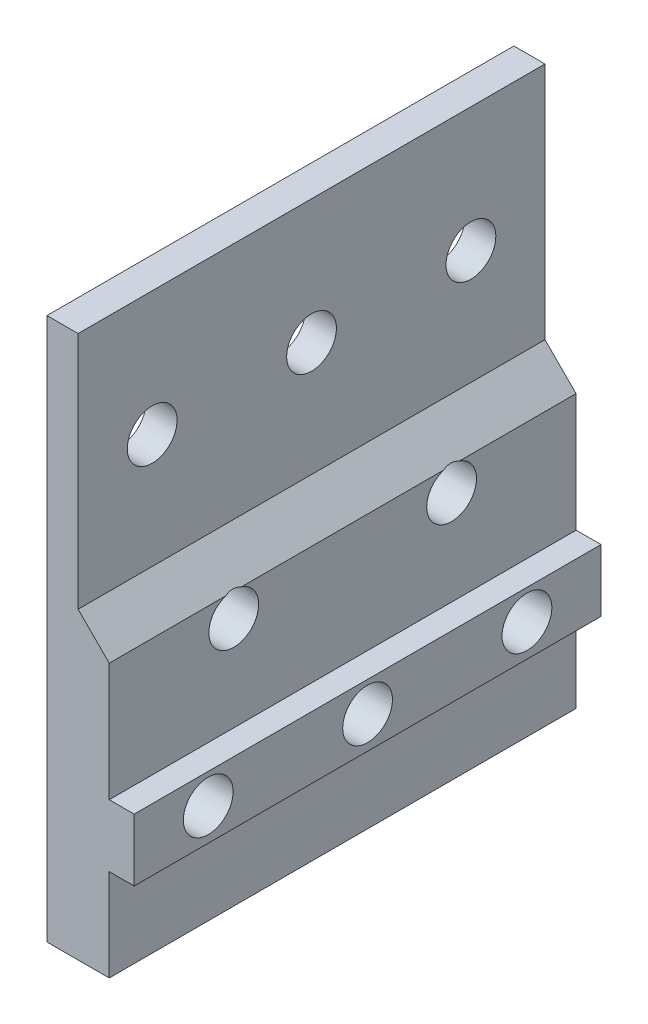
ISO-10303-21;
HEADER;
FILE_DESCRIPTION(('STEP AP214'),'2;1');
FILE_NAME('part.step','',(''),(''),'','','');
FILE_SCHEMA(('AUTOMOTIVE_DESIGN { 1 0 10303 214 1 1 1 1 }'));
ENDSEC;
DATA;
#1=APPLICATION_CONTEXT('core data for automotive mechanical design processes');
#2=APPLICATION_PROTOCOL_DEFINITION('international standard','automotive_design',2000,#1);
#3=PRODUCT_CONTEXT('',#1,'mechanical');
#4=PRODUCT('Part','Part','',(#3));
#5=PRODUCT_RELATED_PRODUCT_CATEGORY('part','',(#4));
#6=PRODUCT_DEFINITION_FORMATION('','',#4);
#7=PRODUCT_DEFINITION_CONTEXT('part definition',#1,'design');
#8=PRODUCT_DEFINITION('design','',#6,#7);
#9=PRODUCT_DEFINITION_SHAPE('','',#8);
#10=(LENGTH_UNIT() NAMED_UNIT(*) SI_UNIT(.MILLI.,.METRE.));
#11=(NAMED_UNIT(*) PLANE_ANGLE_UNIT() SI_UNIT($,.RADIAN.));
#12=(NAMED_UNIT(*) SI_UNIT($,.STERADIAN.) SOLID_ANGLE_UNIT());
#13=UNCERTAINTY_MEASURE_WITH_UNIT(LENGTH_MEASURE(1.E-05),#10,'distance_accuracy_value','');
#14=(GEOMETRIC_REPRESENTATION_CONTEXT(3) GLOBAL_UNCERTAINTY_ASSIGNED_CONTEXT((#13)) GLOBAL_UNIT_ASSIGNED_CONTEXT((#10,
#11,#12)) REPRESENTATION_CONTEXT('',''));
#15=CARTESIAN_POINT('',(0.,0.,0.));
#16=DIRECTION('',(0.,0.,1.));
#17=DIRECTION('',(1.,0.,0.));
#18=AXIS2_PLACEMENT_3D('',#15,#16,#17);
#19=CARTESIAN_POINT('',(6.35,0.,47.625));
#20=DIRECTION('',(0.,1.,0.));
#21=DIRECTION('',(-1.,0.,0.));
#22=AXIS2_PLACEMENT_3D('',#19,#20,#21);
#23=PLANE('',#22);
#24=DIRECTION('',(1.,0.,0.));
#25=VECTOR('',#24,1.);
#26=CARTESIAN_POINT('',(6.35,0.,0.));
#27=LINE('',#26,#25);
#28=CARTESIAN_POINT('',(0.,0.,0.));
#29=VERTEX_POINT('',#28);
#30=CARTESIAN_POINT('',(6.35,0.,0.));
#31=VERTEX_POINT('',#30);
#32=EDGE_CURVE('E169',#29,#31,#27,.T.);
#33=ORIENTED_EDGE('',*,*,#32,.T.);
#34=DIRECTION('',(0.,0.,-1.));
#35=VECTOR('',#34,1.);
#36=CARTESIAN_POINT('',(6.35,0.,47.625));
#37=LINE('',#36,#35);
#38=CARTESIAN_POINT('',(6.35,0.,47.625));
#39=VERTEX_POINT('',#38);
#40=EDGE_CURVE('E11',#39,#31,#37,.T.);
#41=ORIENTED_EDGE('',*,*,#40,.F.);
#42=DIRECTION('',(1.,0.,0.));
#43=VECTOR('',#42,1.);
#44=CARTESIAN_POINT('',(6.35,0.,47.625));
#45=LINE('',#44,#43);
#46=CARTESIAN_POINT('',(0.,0.,47.625));
#47=VERTEX_POINT('',#46);
#48=EDGE_CURVE('E184',#47,#39,#45,.T.);
#49=ORIENTED_EDGE('',*,*,#48,.F.);
#50=DIRECTION('',(0.,0.,-1.));
#51=VECTOR('',#50,1.);
#52=CARTESIAN_POINT('',(0.,0.,47.625));
#53=LINE('',#52,#51);
#54=EDGE_CURVE('E185',#47,#29,#53,.T.);
#55=ORIENTED_EDGE('',*,*,#54,.T.);
#56=EDGE_LOOP('',(#33,#41,#49,#55));
#57=FACE_BOUND('',#56,.T.);
#58=ADVANCED_FACE('F33',(#57),#23,.F.);
#59=CARTESIAN_POINT('',(6.35,9.398,47.625));
#60=DIRECTION('',(-1.,0.,0.));
#61=DIRECTION('',(0.,-1.,0.));
#62=AXIS2_PLACEMENT_3D('',#59,#60,#61);
#63=PLANE('',#62);
#64=DIRECTION('',(0.,1.,0.));
#65=VECTOR('',#64,1.);
#66=CARTESIAN_POINT('',(6.35,9.398,0.));
#67=LINE('',#66,#65);
#68=CARTESIAN_POINT('',(6.35,9.398,0.));
#69=VERTEX_POINT('',#68);
#70=EDGE_CURVE('E163',#31,#69,#67,.T.);
#71=ORIENTED_EDGE('',*,*,#70,.T.);
#72=DIRECTION('',(0.,0.,-1.));
#73=VECTOR('',#72,1.);
#74=CARTESIAN_POINT('',(6.35,9.398,47.625));
#75=LINE('',#74,#73);
#76=CARTESIAN_POINT('',(6.35,9.398,47.625));
#77=VERTEX_POINT('',#76);
#78=EDGE_CURVE('E40',#77,#69,#75,.T.);
#79=ORIENTED_EDGE('',*,*,#78,.F.);
#80=DIRECTION('',(0.,1.,0.));
#81=VECTOR('',#80,1.);
#82=CARTESIAN_POINT('',(6.35,9.398,47.625));
#83=LINE('',#82,#81);
#84=EDGE_CURVE('E233',#39,#77,#83,.T.);
#85=ORIENTED_EDGE('',*,*,#84,.F.);
#86=ORIENTED_EDGE('',*,*,#40,.T.);
#87=EDGE_LOOP('',(#71,#79,#85,#86));
#88=FACE_BOUND('',#87,.T.);
#89=ADVANCED_FACE('F254',(#88),#63,.F.);
#90=CARTESIAN_POINT('',(8.89,9.398,47.625));
#91=DIRECTION('',(0.,1.,0.));
#92=DIRECTION('',(-1.,0.,0.));
#93=AXIS2_PLACEMENT_3D('',#90,#91,#92);
#94=PLANE('',#93);
#95=DIRECTION('',(1.,0.,0.));
#96=VECTOR('',#95,1.);
#97=CARTESIAN_POINT('',(8.89,9.398,0.));
#98=LINE('',#97,#96);
#99=CARTESIAN_POINT('',(8.89,9.398,0.));
#100=VERTEX_POINT('',#99);
#101=EDGE_CURVE('E156',#69,#100,#98,.T.);
#102=ORIENTED_EDGE('',*,*,#101,.T.);
#103=DIRECTION('',(0.,0.,-1.));
#104=VECTOR('',#103,1.);
#105=CARTESIAN_POINT('',(8.89,9.398,47.625));
#106=LINE('',#105,#104);
#107=CARTESIAN_POINT('',(8.89,9.398,47.625));
#108=VERTEX_POINT('',#107);
#109=EDGE_CURVE('E147',#108,#100,#106,.T.);
#110=ORIENTED_EDGE('',*,*,#109,.F.);
#111=DIRECTION('',(1.,0.,0.));
#112=VECTOR('',#111,1.);
#113=CARTESIAN_POINT('',(8.89,9.398,47.625));
#114=LINE('',#113,#112);
#115=EDGE_CURVE('E157',#77,#108,#114,.T.);
#116=ORIENTED_EDGE('',*,*,#115,.F.);
#117=ORIENTED_EDGE('',*,*,#78,.T.);
#118=EDGE_LOOP('',(#102,#110,#116,#117));
#119=FACE_BOUND('',#118,.T.);
#120=ADVANCED_FACE('F154',(#119),#94,.F.);
#121=CARTESIAN_POINT('',(8.89,15.748,47.625));
#122=DIRECTION('',(-1.,0.,0.));
#123=DIRECTION('',(0.,-1.,0.));
#124=AXIS2_PLACEMENT_3D('',#121,#122,#123);
#125=PLANE('',#124);
#126=CARTESIAN_POINT('',(8.89,12.7,7.5565));
#127=DIRECTION('',(-1.,0.,0.));
#128=DIRECTION('',(0.,0.,1.));
#129=AXIS2_PLACEMENT_3D('',#126,#127,#128);
#130=CIRCLE('',#129,2.54);
#131=CARTESIAN_POINT('',(8.89,12.7,10.0965));
#132=VERTEX_POINT('',#131);
#133=EDGE_CURVE('E332',#132,#132,#130,.T.);
#134=ORIENTED_EDGE('',*,*,#133,.T.);
#135=EDGE_LOOP('',(#134));
#136=FACE_BOUND('',#135,.T.);
#137=CARTESIAN_POINT('',(8.89,12.7,23.8125));
#138=DIRECTION('',(-1.,0.,0.));
#139=DIRECTION('',(0.,0.,1.));
#140=AXIS2_PLACEMENT_3D('',#137,#138,#139);
#141=CIRCLE('',#140,2.54);
#142=CARTESIAN_POINT('',(8.89,12.7,26.3525));
#143=VERTEX_POINT('',#142);
#144=EDGE_CURVE('E353',#143,#143,#141,.T.);
#145=ORIENTED_EDGE('',*,*,#144,.T.);
#146=EDGE_LOOP('',(#145));
#147=FACE_BOUND('',#146,.T.);
#148=CARTESIAN_POINT('',(8.89,12.7,40.0685));
#149=DIRECTION('',(-1.,0.,0.));
#150=DIRECTION('',(0.,0.,1.));
#151=AXIS2_PLACEMENT_3D('',#148,#149,#150);
#152=CIRCLE('',#151,2.54000000000001);
#153=CARTESIAN_POINT('',(8.89,12.7,42.6085));
#154=VERTEX_POINT('',#153);
#155=EDGE_CURVE('E326',#154,#154,#152,.T.);
#156=ORIENTED_EDGE('',*,*,#155,.T.);
#157=EDGE_LOOP('',(#156));
#158=FACE_BOUND('',#157,.T.);
#159=DIRECTION('',(0.,1.,0.));
#160=VECTOR('',#159,1.);
#161=CARTESIAN_POINT('',(8.89,15.748,0.));
#162=LINE('',#161,#160);
#163=CARTESIAN_POINT('',(8.89,15.748,0.));
#164=VERTEX_POINT('',#163);
#165=EDGE_CURVE('E165',#100,#164,#162,.T.);
#166=ORIENTED_EDGE('',*,*,#165,.T.);
#167=DIRECTION('',(0.,0.,-1.));
#168=VECTOR('',#167,1.);
#169=CARTESIAN_POINT('',(8.89,15.748,47.625));
#170=LINE('',#169,#168);
#171=CARTESIAN_POINT('',(8.89,15.748,47.625));
#172=VERTEX_POINT('',#171);
#173=EDGE_CURVE('E144',#172,#164,#170,.T.);
#174=ORIENTED_EDGE('',*,*,#173,.F.);
#175=DIRECTION('',(0.,1.,0.));
#176=VECTOR('',#175,1.);
#177=CARTESIAN_POINT('',(8.89,15.748,47.625));
#178=LINE('',#177,#176);
#179=EDGE_CURVE('E236',#108,#172,#178,.T.);
#180=ORIENTED_EDGE('',*,*,#179,.F.);
#181=ORIENTED_EDGE('',*,*,#109,.T.);
#182=EDGE_LOOP('',(#166,#174,#180,#181));
#183=FACE_BOUND('',#182,.T.);
#184=ADVANCED_FACE('F253',(#136,#147,#158,#183),#125,.F.);
#185=CARTESIAN_POINT('',(6.35,15.748,47.625));
#186=DIRECTION('',(0.,-1.,0.));
#187=DIRECTION('',(0.,0.,-1.));
#188=AXIS2_PLACEMENT_3D('',#185,#186,#187);
#189=PLANE('',#188);
#190=DIRECTION('',(-1.,0.,0.));
#191=VECTOR('',#190,1.);
#192=CARTESIAN_POINT('',(6.35,15.748,0.));
#193=LINE('',#192,#191);
#194=CARTESIAN_POINT('',(6.35,15.748,0.));
#195=VERTEX_POINT('',#194);
#196=EDGE_CURVE('E167',#164,#195,#193,.T.);
#197=ORIENTED_EDGE('',*,*,#196,.T.);
#198=DIRECTION('',(0.,0.,-1.));
#199=VECTOR('',#198,1.);
#200=CARTESIAN_POINT('',(6.35,15.748,47.625));
#201=LINE('',#200,#199);
#202=CARTESIAN_POINT('',(6.35,15.748,47.625));
#203=VERTEX_POINT('',#202);
#204=EDGE_CURVE('E137',#203,#195,#201,.T.);
#205=ORIENTED_EDGE('',*,*,#204,.F.);
#206=DIRECTION('',(-1.,0.,0.));
#207=VECTOR('',#206,1.);
#208=CARTESIAN_POINT('',(6.35,15.748,47.625));
#209=LINE('',#208,#207);
#210=EDGE_CURVE('E238',#172,#203,#209,.T.);
#211=ORIENTED_EDGE('',*,*,#210,.F.);
#212=ORIENTED_EDGE('',*,*,#173,.T.);
#213=EDGE_LOOP('',(#197,#205,#211,#212));
#214=FACE_BOUND('',#213,.T.);
#215=ADVANCED_FACE('F249',(#214),#189,.F.);
#216=CARTESIAN_POINT('',(6.35,27.813,47.625));
#217=DIRECTION('',(-1.,0.,0.));
#218=DIRECTION('',(0.,-1.,0.));
#219=AXIS2_PLACEMENT_3D('',#216,#217,#218);
#220=PLANE('',#219);
#221=DIRECTION('',(0.,0.,-1.));
#222=VECTOR('',#221,1.);
#223=CARTESIAN_POINT('',(6.35,27.813,47.625));
#224=LINE('',#223,#222);
#225=CARTESIAN_POINT('',(6.35,27.813,34.1318852542035));
#226=VERTEX_POINT('',#225);
#227=CARTESIAN_POINT('',(6.35,27.813,13.4931147457965));
#228=VERTEX_POINT('',#227);
#229=EDGE_CURVE('E128',#226,#228,#224,.T.);
#230=ORIENTED_EDGE('',*,*,#229,.F.);
#231=CARTESIAN_POINT('',(6.35,25.4,34.925));
#232=DIRECTION('',(-1.,0.,0.));
#233=DIRECTION('',(0.,-1.,0.));
#234=AXIS2_PLACEMENT_3D('',#231,#232,#233);
#235=CIRCLE('',#234,2.54);
#236=CARTESIAN_POINT('',(6.35,27.813,35.7181147457965));
#237=VERTEX_POINT('',#236);
#238=EDGE_CURVE('E53',#226,#237,#235,.T.);
#239=ORIENTED_EDGE('',*,*,#238,.T.);
#240=CARTESIAN_POINT('',(6.35,27.813,47.625));
#241=VERTEX_POINT('',#240);
#242=EDGE_CURVE('E135',#241,#237,#224,.T.);
#243=ORIENTED_EDGE('',*,*,#242,.F.);
#244=DIRECTION('',(0.,1.,0.));
#245=VECTOR('',#244,1.);
#246=CARTESIAN_POINT('',(6.35,27.813,47.625));
#247=LINE('',#246,#245);
#248=EDGE_CURVE('E240',#203,#241,#247,.T.);
#249=ORIENTED_EDGE('',*,*,#248,.F.);
#250=ORIENTED_EDGE('',*,*,#204,.T.);
#251=DIRECTION('',(0.,1.,0.));
#252=VECTOR('',#251,1.);
#253=CARTESIAN_POINT('',(6.35,27.813,0.));
#254=LINE('',#253,#252);
#255=CARTESIAN_POINT('',(6.35,27.813,0.));
#256=VERTEX_POINT('',#255);
#257=EDGE_CURVE('E174',#195,#256,#254,.T.);
#258=ORIENTED_EDGE('',*,*,#257,.T.);
#259=CARTESIAN_POINT('',(6.35,27.813,11.9068852542035));
#260=VERTEX_POINT('',#259);
#261=EDGE_CURVE('E130',#260,#256,#224,.T.);
#262=ORIENTED_EDGE('',*,*,#261,.F.);
#263=CARTESIAN_POINT('',(6.35,25.4,12.7));
#264=DIRECTION('',(-1.,0.,0.));
#265=DIRECTION('',(0.,-1.,0.));
#266=AXIS2_PLACEMENT_3D('',#263,#264,#265);
#267=CIRCLE('',#266,2.54);
#268=EDGE_CURVE('E46',#260,#228,#267,.T.);
#269=ORIENTED_EDGE('',*,*,#268,.T.);
#270=EDGE_LOOP('',(#230,#239,#243,#249,#250,#258,#262,#269));
#271=FACE_BOUND('',#270,.T.);
#272=ADVANCED_FACE('F127',(#271),#220,.F.);
#273=CARTESIAN_POINT('',(3.175,30.988,47.625));
#274=DIRECTION('',(-0.707106781186546,-0.707106781186549,0.));
#275=DIRECTION('',(0.707106781186549,-0.707106781186546,0.));
#276=AXIS2_PLACEMENT_3D('',#273,#274,#275);
#277=PLANE('',#276);
#278=ORIENTED_EDGE('',*,*,#242,.T.);
#279=CARTESIAN_POINT('',(8.76300000000003,25.4,34.925));
#280=DIRECTION('',(-0.707106781186546,-0.707106781186549,0.));
#281=DIRECTION('',(-0.707106781186549,0.707106781186546,0.));
#282=AXIS2_PLACEMENT_3D('',#279,#280,#281);
#283=ELLIPSE('',#282,3.59210244842767,2.54);
#284=EDGE_CURVE('E131',#237,#226,#283,.T.);
#285=ORIENTED_EDGE('',*,*,#284,.T.);
#286=ORIENTED_EDGE('',*,*,#229,.T.);
#287=CARTESIAN_POINT('',(8.76300000000003,25.4,12.7));
#288=DIRECTION('',(-0.707106781186546,-0.707106781186549,0.));
#289=DIRECTION('',(-0.707106781186549,0.707106781186546,0.));
#290=AXIS2_PLACEMENT_3D('',#287,#288,#289);
#291=ELLIPSE('',#290,3.59210244842767,2.54);
#292=EDGE_CURVE('E118',#228,#260,#291,.T.);
#293=ORIENTED_EDGE('',*,*,#292,.T.);
#294=ORIENTED_EDGE('',*,*,#261,.T.);
#295=DIRECTION('',(-0.707106781186549,0.707106781186546,0.));
#296=VECTOR('',#295,1.);
#297=CARTESIAN_POINT('',(3.175,30.988,0.));
#298=LINE('',#297,#296);
#299=CARTESIAN_POINT('',(3.175,30.988,0.));
#300=VERTEX_POINT('',#299);
#301=EDGE_CURVE('E176',#256,#300,#298,.T.);
#302=ORIENTED_EDGE('',*,*,#301,.T.);
#303=DIRECTION('',(0.,0.,-1.));
#304=VECTOR('',#303,1.);
#305=CARTESIAN_POINT('',(3.175,30.988,47.625));
#306=LINE('',#305,#304);
#307=CARTESIAN_POINT('',(3.175,30.988,47.625));
#308=VERTEX_POINT('',#307);
#309=EDGE_CURVE('E138',#308,#300,#306,.T.);
#310=ORIENTED_EDGE('',*,*,#309,.F.);
#311=DIRECTION('',(-0.707106781186549,0.707106781186546,0.));
#312=VECTOR('',#311,1.);
#313=CARTESIAN_POINT('',(3.175,30.988,47.625));
#314=LINE('',#313,#312);
#315=EDGE_CURVE('E242',#241,#308,#314,.T.);
#316=ORIENTED_EDGE('',*,*,#315,.F.);
#317=EDGE_LOOP('',(#278,#285,#286,#293,#294,#302,#310,#316));
#318=FACE_BOUND('',#317,.T.);
#319=ADVANCED_FACE('F134',(#318),#277,.F.);
#320=CARTESIAN_POINT('',(3.175,55.3466,47.625));
#321=DIRECTION('',(-1.,0.,0.));
#322=DIRECTION('',(0.,-1.,0.));
#323=AXIS2_PLACEMENT_3D('',#320,#321,#322);
#324=PLANE('',#323);
#325=CARTESIAN_POINT('',(3.175,42.6466,7.5565));
#326=DIRECTION('',(-1.,0.,0.));
#327=DIRECTION('',(0.,-1.,0.));
#328=AXIS2_PLACEMENT_3D('',#325,#326,#327);
#329=CIRCLE('',#328,2.54);
#330=CARTESIAN_POINT('',(3.175,40.1066,7.5565));
#331=VERTEX_POINT('',#330);
#332=EDGE_CURVE('E222',#331,#331,#329,.T.);
#333=ORIENTED_EDGE('',*,*,#332,.T.);
#334=EDGE_LOOP('',(#333));
#335=FACE_BOUND('',#334,.T.);
#336=CARTESIAN_POINT('',(3.175,42.6466,23.8125));
#337=DIRECTION('',(-1.,0.,0.));
#338=DIRECTION('',(0.,-1.,0.));
#339=AXIS2_PLACEMENT_3D('',#336,#337,#338);
#340=CIRCLE('',#339,2.54);
#341=CARTESIAN_POINT('',(3.175,40.1066,23.8125));
#342=VERTEX_POINT('',#341);
#343=EDGE_CURVE('E123',#342,#342,#340,.T.);
#344=ORIENTED_EDGE('',*,*,#343,.T.);
#345=EDGE_LOOP('',(#344));
#346=FACE_BOUND('',#345,.T.);
#347=CARTESIAN_POINT('',(3.175,42.6466,40.0685));
#348=DIRECTION('',(-1.,0.,0.));
#349=DIRECTION('',(0.,-1.,0.));
#350=AXIS2_PLACEMENT_3D('',#347,#348,#349);
#351=CIRCLE('',#350,2.54000000000001);
#352=CARTESIAN_POINT('',(3.175,40.1066,40.0685));
#353=VERTEX_POINT('',#352);
#354=EDGE_CURVE('E323',#353,#353,#351,.T.);
#355=ORIENTED_EDGE('',*,*,#354,.T.);
#356=EDGE_LOOP('',(#355));
#357=FACE_BOUND('',#356,.T.);
#358=DIRECTION('',(0.,1.,0.));
#359=VECTOR('',#358,1.);
#360=CARTESIAN_POINT('',(3.175,55.3466,0.));
#361=LINE('',#360,#359);
#362=CARTESIAN_POINT('',(3.175,55.3466,0.));
#363=VERTEX_POINT('',#362);
#364=EDGE_CURVE('E178',#300,#363,#361,.T.);
#365=ORIENTED_EDGE('',*,*,#364,.T.);
#366=DIRECTION('',(0.,0.,-1.));
#367=VECTOR('',#366,1.);
#368=CARTESIAN_POINT('',(3.175,55.3466,47.625));
#369=LINE('',#368,#367);
#370=CARTESIAN_POINT('',(3.175,55.3466,47.625));
#371=VERTEX_POINT('',#370);
#372=EDGE_CURVE('E191',#371,#363,#369,.T.);
#373=ORIENTED_EDGE('',*,*,#372,.F.);
#374=DIRECTION('',(0.,1.,0.));
#375=VECTOR('',#374,1.);
#376=CARTESIAN_POINT('',(3.175,55.3466,47.625));
#377=LINE('',#376,#375);
#378=EDGE_CURVE('E203',#308,#371,#377,.T.);
#379=ORIENTED_EDGE('',*,*,#378,.F.);
#380=ORIENTED_EDGE('',*,*,#309,.T.);
#381=EDGE_LOOP('',(#365,#373,#379,#380));
#382=FACE_BOUND('',#381,.T.);
#383=ADVANCED_FACE('F202',(#335,#346,#357,#382),#324,.F.);
#384=CARTESIAN_POINT('',(0.,55.3466,47.625));
#385=DIRECTION('',(0.,-1.,0.));
#386=DIRECTION('',(0.,0.,-1.));
#387=AXIS2_PLACEMENT_3D('',#384,#385,#386);
#388=PLANE('',#387);
#389=DIRECTION('',(-1.,0.,0.));
#390=VECTOR('',#389,1.);
#391=CARTESIAN_POINT('',(0.,55.3466,0.));
#392=LINE('',#391,#390);
#393=CARTESIAN_POINT('',(0.,55.3466,0.));
#394=VERTEX_POINT('',#393);
#395=EDGE_CURVE('E180',#363,#394,#392,.T.);
#396=ORIENTED_EDGE('',*,*,#395,.T.);
#397=DIRECTION('',(0.,0.,-1.));
#398=VECTOR('',#397,1.);
#399=CARTESIAN_POINT('',(0.,55.3466,47.625));
#400=LINE('',#399,#398);
#401=CARTESIAN_POINT('',(0.,55.3466,47.625));
#402=VERTEX_POINT('',#401);
#403=EDGE_CURVE('E188',#402,#394,#400,.T.);
#404=ORIENTED_EDGE('',*,*,#403,.F.);
#405=DIRECTION('',(-1.,0.,0.));
#406=VECTOR('',#405,1.);
#407=CARTESIAN_POINT('',(0.,55.3466,47.625));
#408=LINE('',#407,#406);
#409=EDGE_CURVE('E217',#371,#402,#408,.T.);
#410=ORIENTED_EDGE('',*,*,#409,.F.);
#411=ORIENTED_EDGE('',*,*,#372,.T.);
#412=EDGE_LOOP('',(#396,#404,#410,#411));
#413=FACE_BOUND('',#412,.T.);
#414=ADVANCED_FACE('F209',(#413),#388,.F.);
#415=CARTESIAN_POINT('',(0.,0.,47.625));
#416=DIRECTION('',(1.,0.,0.));
#417=DIRECTION('',(0.,0.,-1.));
#418=AXIS2_PLACEMENT_3D('',#415,#416,#417);
#419=PLANE('',#418);
#420=CARTESIAN_POINT('',(0.,42.6466,7.5565));
#421=DIRECTION('',(-1.,0.,0.));
#422=DIRECTION('',(0.,0.,1.));
#423=AXIS2_PLACEMENT_3D('',#420,#421,#422);
#424=CIRCLE('',#423,2.54);
#425=CARTESIAN_POINT('',(0.,42.6466,10.0965));
#426=VERTEX_POINT('',#425);
#427=EDGE_CURVE('E344',#426,#426,#424,.T.);
#428=ORIENTED_EDGE('',*,*,#427,.F.);
#429=EDGE_LOOP('',(#428));
#430=FACE_BOUND('',#429,.T.);
#431=CARTESIAN_POINT('',(0.,25.4,34.925));
#432=DIRECTION('',(-1.,0.,0.));
#433=DIRECTION('',(0.,0.,1.));
#434=AXIS2_PLACEMENT_3D('',#431,#432,#433);
#435=CIRCLE('',#434,2.54);
#436=CARTESIAN_POINT('',(0.,25.4,37.465));
#437=VERTEX_POINT('',#436);
#438=EDGE_CURVE('E339',#437,#437,#435,.T.);
#439=ORIENTED_EDGE('',*,*,#438,.F.);
#440=EDGE_LOOP('',(#439));
#441=FACE_BOUND('',#440,.T.);
#442=CARTESIAN_POINT('',(0.,25.4,12.7));
#443=DIRECTION('',(-1.,0.,0.));
#444=DIRECTION('',(0.,0.,1.));
#445=AXIS2_PLACEMENT_3D('',#442,#443,#444);
#446=CIRCLE('',#445,2.54);
#447=CARTESIAN_POINT('',(0.,25.4,15.24));
#448=VERTEX_POINT('',#447);
#449=EDGE_CURVE('E335',#448,#448,#446,.T.);
#450=ORIENTED_EDGE('',*,*,#449,.F.);
#451=EDGE_LOOP('',(#450));
#452=FACE_BOUND('',#451,.T.);
#453=CARTESIAN_POINT('',(0.,12.7,7.5565));
#454=DIRECTION('',(-1.,0.,0.));
#455=DIRECTION('',(0.,0.,1.));
#456=AXIS2_PLACEMENT_3D('',#453,#454,#455);
#457=CIRCLE('',#456,2.54);
#458=CARTESIAN_POINT('',(0.,12.7,10.0965));
#459=VERTEX_POINT('',#458);
#460=EDGE_CURVE('E338',#459,#459,#457,.T.);
#461=ORIENTED_EDGE('',*,*,#460,.F.);
#462=EDGE_LOOP('',(#461));
#463=FACE_BOUND('',#462,.T.);
#464=CARTESIAN_POINT('',(0.,42.6466,23.8125));
#465=DIRECTION('',(-1.,0.,0.));
#466=DIRECTION('',(0.,0.,1.));
#467=AXIS2_PLACEMENT_3D('',#464,#465,#466);
#468=CIRCLE('',#467,2.54);
#469=CARTESIAN_POINT('',(0.,42.6466,26.3525));
#470=VERTEX_POINT('',#469);
#471=EDGE_CURVE('E319',#470,#470,#468,.T.);
#472=ORIENTED_EDGE('',*,*,#471,.F.);
#473=EDGE_LOOP('',(#472));
#474=FACE_BOUND('',#473,.T.);
#475=CARTESIAN_POINT('',(0.,12.7,23.8125));
#476=DIRECTION('',(-1.,0.,0.));
#477=DIRECTION('',(0.,0.,1.));
#478=AXIS2_PLACEMENT_3D('',#475,#476,#477);
#479=CIRCLE('',#478,2.54);
#480=CARTESIAN_POINT('',(0.,12.7,26.3525));
#481=VERTEX_POINT('',#480);
#482=EDGE_CURVE('E350',#481,#481,#479,.T.);
#483=ORIENTED_EDGE('',*,*,#482,.F.);
#484=EDGE_LOOP('',(#483));
#485=FACE_BOUND('',#484,.T.);
#486=CARTESIAN_POINT('',(0.,42.6466,40.0685));
#487=DIRECTION('',(-1.,0.,0.));
#488=DIRECTION('',(0.,0.,1.));
#489=AXIS2_PLACEMENT_3D('',#486,#487,#488);
#490=CIRCLE('',#489,2.54000000000001);
#491=CARTESIAN_POINT('',(0.,42.6466,42.6085));
#492=VERTEX_POINT('',#491);
#493=EDGE_CURVE('E347',#492,#492,#490,.T.);
#494=ORIENTED_EDGE('',*,*,#493,.F.);
#495=EDGE_LOOP('',(#494));
#496=FACE_BOUND('',#495,.T.);
#497=CARTESIAN_POINT('',(0.,12.7,40.0685));
#498=DIRECTION('',(-1.,0.,0.));
#499=DIRECTION('',(0.,0.,1.));
#500=AXIS2_PLACEMENT_3D('',#497,#498,#499);
#501=CIRCLE('',#500,2.54000000000001);
#502=CARTESIAN_POINT('',(0.,12.7,42.6085));
#503=VERTEX_POINT('',#502);
#504=EDGE_CURVE('E329',#503,#503,#501,.T.);
#505=ORIENTED_EDGE('',*,*,#504,.F.);
#506=EDGE_LOOP('',(#505));
#507=FACE_BOUND('',#506,.T.);
#508=DIRECTION('',(0.,-1.,0.));
#509=VECTOR('',#508,1.);
#510=CARTESIAN_POINT('',(0.,0.,0.));
#511=LINE('',#510,#509);
#512=EDGE_CURVE('E182',#394,#29,#511,.T.);
#513=ORIENTED_EDGE('',*,*,#512,.T.);
#514=ORIENTED_EDGE('',*,*,#54,.F.);
#515=DIRECTION('',(0.,-1.,0.));
#516=VECTOR('',#515,1.);
#517=CARTESIAN_POINT('',(0.,0.,47.625));
#518=LINE('',#517,#516);
#519=EDGE_CURVE('E189',#402,#47,#518,.T.);
#520=ORIENTED_EDGE('',*,*,#519,.F.);
#521=ORIENTED_EDGE('',*,*,#403,.T.);
#522=EDGE_LOOP('',(#513,#514,#520,#521));
#523=FACE_BOUND('',#522,.T.);
#524=ADVANCED_FACE('F212',(#430,#441,#452,#463,#474,#485,#496,#507,#523),#419,.F.);
#525=CARTESIAN_POINT('',(0.,0.,47.625));
#526=DIRECTION('',(0.,0.,-1.));
#527=DIRECTION('',(-1.,0.,0.));
#528=AXIS2_PLACEMENT_3D('',#525,#526,#527);
#529=PLANE('',#528);
#530=ORIENTED_EDGE('',*,*,#48,.T.);
#531=ORIENTED_EDGE('',*,*,#84,.T.);
#532=ORIENTED_EDGE('',*,*,#115,.T.);
#533=ORIENTED_EDGE('',*,*,#179,.T.);
#534=ORIENTED_EDGE('',*,*,#210,.T.);
#535=ORIENTED_EDGE('',*,*,#248,.T.);
#536=ORIENTED_EDGE('',*,*,#315,.T.);
#537=ORIENTED_EDGE('',*,*,#378,.T.);
#538=ORIENTED_EDGE('',*,*,#409,.T.);
#539=ORIENTED_EDGE('',*,*,#519,.T.);
#540=EDGE_LOOP('',(#530,#531,#532,#533,#534,#535,#536,#537,#538,#539));
#541=FACE_BOUND('',#540,.T.);
#542=ADVANCED_FACE('F243',(#541),#529,.F.);
#543=CARTESIAN_POINT('',(0.,0.,0.));
#544=DIRECTION('',(0.,0.,-1.));
#545=DIRECTION('',(-1.,0.,0.));
#546=AXIS2_PLACEMENT_3D('',#543,#544,#545);
#547=PLANE('',#546);
#548=ORIENTED_EDGE('',*,*,#32,.F.);
#549=ORIENTED_EDGE('',*,*,#512,.F.);
#550=ORIENTED_EDGE('',*,*,#395,.F.);
#551=ORIENTED_EDGE('',*,*,#364,.F.);
#552=ORIENTED_EDGE('',*,*,#301,.F.);
#553=ORIENTED_EDGE('',*,*,#257,.F.);
#554=ORIENTED_EDGE('',*,*,#196,.F.);
#555=ORIENTED_EDGE('',*,*,#165,.F.);
#556=ORIENTED_EDGE('',*,*,#101,.F.);
#557=ORIENTED_EDGE('',*,*,#70,.F.);
#558=EDGE_LOOP('',(#548,#549,#550,#551,#552,#553,#554,#555,#556,#557));
#559=FACE_BOUND('',#558,.T.);
#560=ADVANCED_FACE('F162',(#559),#547,.T.);
#561=CARTESIAN_POINT('',(8.89,12.7,40.0685));
#562=DIRECTION('',(-1.,0.,0.));
#563=DIRECTION('',(0.,0.,1.));
#564=AXIS2_PLACEMENT_3D('',#561,#562,#563);
#565=CYLINDRICAL_SURFACE('',#564,2.54000000000001);
#566=ORIENTED_EDGE('',*,*,#155,.F.);
#567=EDGE_LOOP('',(#566));
#568=FACE_BOUND('',#567,.T.);
#569=ORIENTED_EDGE('',*,*,#504,.T.);
#570=EDGE_LOOP('',(#569));
#571=FACE_BOUND('',#570,.T.);
#572=ADVANCED_FACE('F282',(#568,#571),#565,.F.);
#573=CARTESIAN_POINT('',(8.89,42.6466,40.0685));
#574=DIRECTION('',(-1.,0.,0.));
#575=DIRECTION('',(0.,0.,1.));
#576=AXIS2_PLACEMENT_3D('',#573,#574,#575);
#577=CYLINDRICAL_SURFACE('',#576,2.54000000000001);
#578=ORIENTED_EDGE('',*,*,#493,.T.);
#579=EDGE_LOOP('',(#578));
#580=FACE_BOUND('',#579,.T.);
#581=ORIENTED_EDGE('',*,*,#354,.F.);
#582=EDGE_LOOP('',(#581));
#583=FACE_BOUND('',#582,.T.);
#584=ADVANCED_FACE('F287',(#580,#583),#577,.F.);
#585=CARTESIAN_POINT('',(8.89,12.7,23.8125));
#586=DIRECTION('',(-1.,0.,0.));
#587=DIRECTION('',(0.,0.,1.));
#588=AXIS2_PLACEMENT_3D('',#585,#586,#587);
#589=CYLINDRICAL_SURFACE('',#588,2.54);
#590=ORIENTED_EDGE('',*,*,#144,.F.);
#591=EDGE_LOOP('',(#590));
#592=FACE_BOUND('',#591,.T.);
#593=ORIENTED_EDGE('',*,*,#482,.T.);
#594=EDGE_LOOP('',(#593));
#595=FACE_BOUND('',#594,.T.);
#596=ADVANCED_FACE('F305',(#592,#595),#589,.F.);
#597=CARTESIAN_POINT('',(8.89,42.6466,23.8125));
#598=DIRECTION('',(-1.,0.,0.));
#599=DIRECTION('',(0.,0.,1.));
#600=AXIS2_PLACEMENT_3D('',#597,#598,#599);
#601=CYLINDRICAL_SURFACE('',#600,2.54);
#602=ORIENTED_EDGE('',*,*,#471,.T.);
#603=EDGE_LOOP('',(#602));
#604=FACE_BOUND('',#603,.T.);
#605=ORIENTED_EDGE('',*,*,#343,.F.);
#606=EDGE_LOOP('',(#605));
#607=FACE_BOUND('',#606,.T.);
#608=ADVANCED_FACE('F296',(#604,#607),#601,.F.);
#609=CARTESIAN_POINT('',(8.89,12.7,7.5565));
#610=DIRECTION('',(-1.,0.,0.));
#611=DIRECTION('',(0.,0.,1.));
#612=AXIS2_PLACEMENT_3D('',#609,#610,#611);
#613=CYLINDRICAL_SURFACE('',#612,2.54);
#614=ORIENTED_EDGE('',*,*,#133,.F.);
#615=EDGE_LOOP('',(#614));
#616=FACE_BOUND('',#615,.T.);
#617=ORIENTED_EDGE('',*,*,#460,.T.);
#618=EDGE_LOOP('',(#617));
#619=FACE_BOUND('',#618,.T.);
#620=ADVANCED_FACE('F292',(#616,#619),#613,.F.);
#621=CARTESIAN_POINT('',(8.89,25.4,12.7));
#622=DIRECTION('',(-1.,0.,0.));
#623=DIRECTION('',(0.,0.,1.));
#624=AXIS2_PLACEMENT_3D('',#621,#622,#623);
#625=CYLINDRICAL_SURFACE('',#624,2.54);
#626=ORIENTED_EDGE('',*,*,#449,.T.);
#627=EDGE_LOOP('',(#626));
#628=FACE_BOUND('',#627,.T.);
#629=ORIENTED_EDGE('',*,*,#292,.F.);
#630=ORIENTED_EDGE('',*,*,#268,.F.);
#631=EDGE_LOOP('',(#629,#630));
#632=FACE_BOUND('',#631,.T.);
#633=ADVANCED_FACE('F119',(#628,#632),#625,.F.);
#634=CARTESIAN_POINT('',(8.89,25.4,34.925));
#635=DIRECTION('',(-1.,0.,0.));
#636=DIRECTION('',(0.,0.,1.));
#637=AXIS2_PLACEMENT_3D('',#634,#635,#636);
#638=CYLINDRICAL_SURFACE('',#637,2.54);
#639=ORIENTED_EDGE('',*,*,#438,.T.);
#640=EDGE_LOOP('',(#639));
#641=FACE_BOUND('',#640,.T.);
#642=ORIENTED_EDGE('',*,*,#284,.F.);
#643=ORIENTED_EDGE('',*,*,#238,.F.);
#644=EDGE_LOOP('',(#642,#643));
#645=FACE_BOUND('',#644,.T.);
#646=ADVANCED_FACE('F291',(#641,#645),#638,.F.);
#647=CARTESIAN_POINT('',(8.89,42.6466,7.5565));
#648=DIRECTION('',(-1.,0.,0.));
#649=DIRECTION('',(0.,0.,1.));
#650=AXIS2_PLACEMENT_3D('',#647,#648,#649);
#651=CYLINDRICAL_SURFACE('',#650,2.54);
#652=ORIENTED_EDGE('',*,*,#427,.T.);
#653=EDGE_LOOP('',(#652));
#654=FACE_BOUND('',#653,.T.);
#655=ORIENTED_EDGE('',*,*,#332,.F.);
#656=EDGE_LOOP('',(#655));
#657=FACE_BOUND('',#656,.T.);
#658=ADVANCED_FACE('F298',(#654,#657),#651,.F.);
#659=CLOSED_SHELL('',(#58,#89,#120,#184,#215,#272,#319,#383,#414,#524,#542,#560,#572,#584,#596,
#608,#620,#633,#646,#658));
#660=MANIFOLD_SOLID_BREP('B2',#659);
#661=ADVANCED_BREP_SHAPE_REPRESENTATION('',(#18,#660),#14);
#662=SHAPE_DEFINITION_REPRESENTATION(#9,#661);
ENDSEC;
END-ISO-10303-21;
